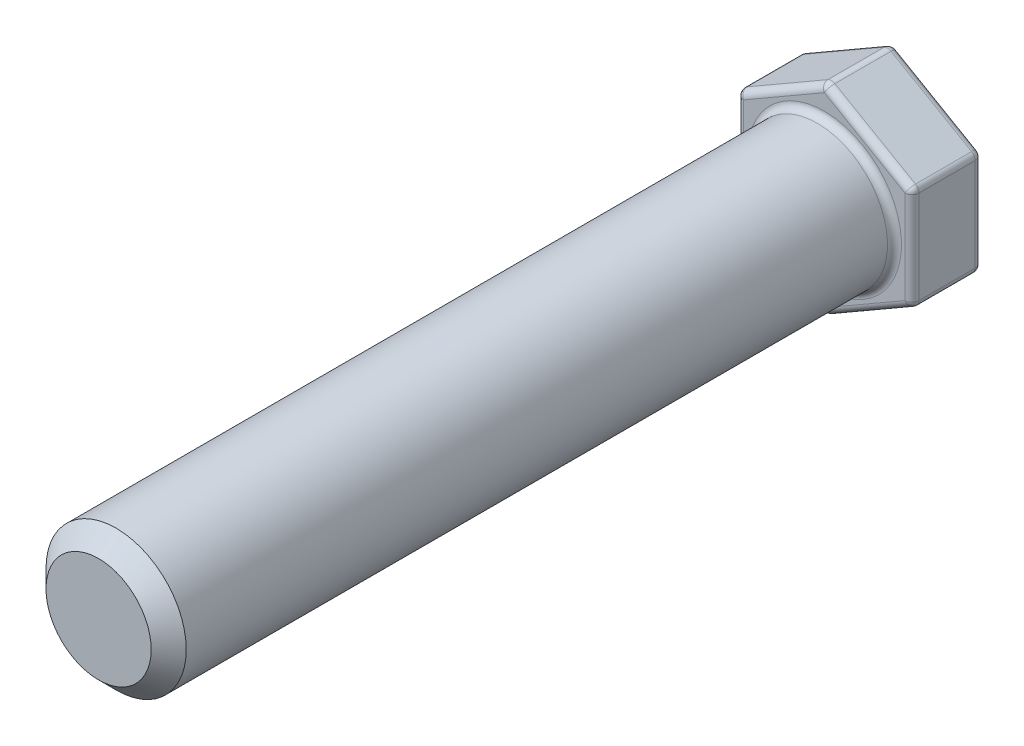
ISO-10303-21;
HEADER;
FILE_DESCRIPTION(('STEP AP214'),'2;1');
FILE_NAME('part.step','',(''),(''),'','','');
FILE_SCHEMA(('AUTOMOTIVE_DESIGN { 1 0 10303 214 1 1 1 1 }'));
ENDSEC;
DATA;
#1=APPLICATION_CONTEXT('core data for automotive mechanical design processes');
#2=APPLICATION_PROTOCOL_DEFINITION('international standard','automotive_design',2000,#1);
#3=PRODUCT_CONTEXT('',#1,'mechanical');
#4=PRODUCT('Part','Part','',(#3));
#5=PRODUCT_RELATED_PRODUCT_CATEGORY('part','',(#4));
#6=PRODUCT_DEFINITION_FORMATION('','',#4);
#7=PRODUCT_DEFINITION_CONTEXT('part definition',#1,'design');
#8=PRODUCT_DEFINITION('design','',#6,#7);
#9=PRODUCT_DEFINITION_SHAPE('','',#8);
#10=(LENGTH_UNIT() NAMED_UNIT(*) SI_UNIT(.MILLI.,.METRE.));
#11=(NAMED_UNIT(*) PLANE_ANGLE_UNIT() SI_UNIT($,.RADIAN.));
#12=(NAMED_UNIT(*) SI_UNIT($,.STERADIAN.) SOLID_ANGLE_UNIT());
#13=UNCERTAINTY_MEASURE_WITH_UNIT(LENGTH_MEASURE(1.E-05),#10,'distance_accuracy_value','');
#14=(GEOMETRIC_REPRESENTATION_CONTEXT(3) GLOBAL_UNCERTAINTY_ASSIGNED_CONTEXT((#13)) GLOBAL_UNIT_ASSIGNED_CONTEXT((#10,
#11,#12)) REPRESENTATION_CONTEXT('',''));
#15=CARTESIAN_POINT('',(0.,0.,0.));
#16=DIRECTION('',(0.,0.,1.));
#17=DIRECTION('',(1.,0.,0.));
#18=AXIS2_PLACEMENT_3D('',#15,#16,#17);
#19=CARTESIAN_POINT('',(0.,0.,20.7));
#20=DIRECTION('',(0.,0.,-1.));
#21=DIRECTION('',(-1.,0.,0.));
#22=AXIS2_PLACEMENT_3D('',#19,#20,#21);
#23=CYLINDRICAL_SURFACE('',#22,2.);
#24=CARTESIAN_POINT('',(0.,0.,20.2));
#25=DIRECTION('',(0.,0.,1.));
#26=DIRECTION('',(1.,0.,0.));
#27=AXIS2_PLACEMENT_3D('',#24,#25,#26);
#28=CIRCLE('',#27,2.);
#29=CARTESIAN_POINT('',(2.,0.,20.2));
#30=VERTEX_POINT('',#29);
#31=EDGE_CURVE('E11',#30,#30,#28,.F.);
#32=ORIENTED_EDGE('',*,*,#31,.T.);
#33=EDGE_LOOP('',(#32));
#34=FACE_BOUND('',#33,.T.);
#35=CARTESIAN_POINT('',(0.,0.,0.199999999999999));
#36=DIRECTION('',(0.,0.,-1.));
#37=DIRECTION('',(-1.,0.,0.));
#38=AXIS2_PLACEMENT_3D('',#35,#36,#37);
#39=CIRCLE('',#38,2.);
#40=CARTESIAN_POINT('',(-2.,0.,0.199999999999999));
#41=VERTEX_POINT('',#40);
#42=EDGE_CURVE('E261',#41,#41,#39,.F.);
#43=ORIENTED_EDGE('',*,*,#42,.T.);
#44=EDGE_LOOP('',(#43));
#45=FACE_BOUND('',#44,.T.);
#46=ADVANCED_FACE('F36',(#34,#45),#23,.T.);
#47=CARTESIAN_POINT('',(0.,0.,20.7));
#48=DIRECTION('',(0.,0.,1.));
#49=DIRECTION('',(1.,0.,0.));
#50=AXIS2_PLACEMENT_3D('',#47,#48,#49);
#51=PLANE('',#50);
#52=CARTESIAN_POINT('',(0.,0.,20.7));
#53=DIRECTION('',(0.,0.,1.));
#54=DIRECTION('',(1.,0.,0.));
#55=AXIS2_PLACEMENT_3D('',#52,#53,#54);
#56=CIRCLE('',#55,1.5);
#57=CARTESIAN_POINT('',(1.5,0.,20.7));
#58=VERTEX_POINT('',#57);
#59=EDGE_CURVE('E44',#58,#58,#56,.T.);
#60=ORIENTED_EDGE('',*,*,#59,.T.);
#61=EDGE_LOOP('',(#60));
#62=FACE_BOUND('',#61,.T.);
#63=ADVANCED_FACE('F362',(#62),#51,.T.);
#64=CARTESIAN_POINT('',(0.,2.88675134594813,-2.));
#65=DIRECTION('',(-0.500000000000001,-0.866025403784438,0.));
#66=DIRECTION('',(0.866025403784438,-0.500000000000001,0.));
#67=AXIS2_PLACEMENT_3D('',#64,#65,#66);
#68=PLANE('',#67);
#69=DIRECTION('',(0.866025403784438,-0.500000000000001,0.));
#70=VECTOR('',#69,1.);
#71=CARTESIAN_POINT('',(0.,2.88675134594813,-1.8));
#72=LINE('',#71,#70);
#73=CARTESIAN_POINT('',(2.4,1.50111069989303,-1.8));
#74=VERTEX_POINT('',#73);
#75=CARTESIAN_POINT('',(0.100000000000001,2.82901631902917,-1.8));
#76=VERTEX_POINT('',#75);
#77=EDGE_CURVE('E238',#74,#76,#72,.F.);
#78=ORIENTED_EDGE('',*,*,#77,.T.);
#79=DIRECTION('',(0.,0.,1.));
#80=VECTOR('',#79,1.);
#81=CARTESIAN_POINT('',(0.100000000000001,2.82901631902917,-2.));
#82=LINE('',#81,#80);
#83=CARTESIAN_POINT('',(0.100000000000001,2.82901631902917,-0.2));
#84=VERTEX_POINT('',#83);
#85=EDGE_CURVE('E309',#76,#84,#82,.T.);
#86=ORIENTED_EDGE('',*,*,#85,.T.);
#87=DIRECTION('',(0.866025403784438,-0.500000000000001,0.));
#88=VECTOR('',#87,1.);
#89=CARTESIAN_POINT('',(0.,2.88675134594813,-0.2));
#90=LINE('',#89,#88);
#91=CARTESIAN_POINT('',(2.4,1.50111069989303,-0.2));
#92=VERTEX_POINT('',#91);
#93=EDGE_CURVE('E235',#84,#92,#90,.T.);
#94=ORIENTED_EDGE('',*,*,#93,.T.);
#95=DIRECTION('',(0.,0.,1.));
#96=VECTOR('',#95,1.);
#97=CARTESIAN_POINT('',(2.4,1.50111069989303,-2.));
#98=LINE('',#97,#96);
#99=EDGE_CURVE('E307',#92,#74,#98,.F.);
#100=ORIENTED_EDGE('',*,*,#99,.T.);
#101=EDGE_LOOP('',(#78,#86,#94,#100));
#102=FACE_BOUND('',#101,.T.);
#103=ADVANCED_FACE('F380',(#102),#68,.F.);
#104=CARTESIAN_POINT('',(2.5,1.44337567297406,-2.));
#105=DIRECTION('',(-1.,0.,0.));
#106=DIRECTION('',(0.,0.,1.));
#107=AXIS2_PLACEMENT_3D('',#104,#105,#106);
#108=PLANE('',#107);
#109=DIRECTION('',(0.,-1.,0.));
#110=VECTOR('',#109,1.);
#111=CARTESIAN_POINT('',(2.5,1.44337567297406,-0.2));
#112=LINE('',#111,#110);
#113=CARTESIAN_POINT('',(2.5,1.32790561913614,-0.2));
#114=VERTEX_POINT('',#113);
#115=CARTESIAN_POINT('',(2.5,-1.32790561913614,-0.2));
#116=VERTEX_POINT('',#115);
#117=EDGE_CURVE('E231',#114,#116,#112,.T.);
#118=ORIENTED_EDGE('',*,*,#117,.T.);
#119=DIRECTION('',(0.,0.,1.));
#120=VECTOR('',#119,1.);
#121=CARTESIAN_POINT('',(2.5,-1.32790561913614,-2.));
#122=LINE('',#121,#120);
#123=CARTESIAN_POINT('',(2.5,-1.32790561913614,-1.8));
#124=VERTEX_POINT('',#123);
#125=EDGE_CURVE('E328',#116,#124,#122,.F.);
#126=ORIENTED_EDGE('',*,*,#125,.T.);
#127=DIRECTION('',(0.,-1.,0.));
#128=VECTOR('',#127,1.);
#129=CARTESIAN_POINT('',(2.5,1.44337567297406,-1.8));
#130=LINE('',#129,#128);
#131=CARTESIAN_POINT('',(2.5,1.32790561913614,-1.8));
#132=VERTEX_POINT('',#131);
#133=EDGE_CURVE('E233',#124,#132,#130,.F.);
#134=ORIENTED_EDGE('',*,*,#133,.T.);
#135=DIRECTION('',(0.,0.,1.));
#136=VECTOR('',#135,1.);
#137=CARTESIAN_POINT('',(2.5,1.32790561913614,-2.));
#138=LINE('',#137,#136);
#139=EDGE_CURVE('E58',#132,#114,#138,.T.);
#140=ORIENTED_EDGE('',*,*,#139,.T.);
#141=EDGE_LOOP('',(#118,#126,#134,#140));
#142=FACE_BOUND('',#141,.T.);
#143=ADVANCED_FACE('F546',(#142),#108,.F.);
#144=CARTESIAN_POINT('',(2.5,-1.44337567297406,-2.));
#145=DIRECTION('',(-0.5,0.866025403784439,0.));
#146=DIRECTION('',(-0.866025403784439,-0.5,0.));
#147=AXIS2_PLACEMENT_3D('',#144,#145,#146);
#148=PLANE('',#147);
#149=DIRECTION('',(-0.866025403784439,-0.5,0.));
#150=VECTOR('',#149,1.);
#151=CARTESIAN_POINT('',(2.5,-1.44337567297406,-0.2));
#152=LINE('',#151,#150);
#153=CARTESIAN_POINT('',(2.4,-1.50111069989303,-0.2));
#154=VERTEX_POINT('',#153);
#155=CARTESIAN_POINT('',(0.099999999999999,-2.82901631902917,-0.2));
#156=VERTEX_POINT('',#155);
#157=EDGE_CURVE('E225',#154,#156,#152,.T.);
#158=ORIENTED_EDGE('',*,*,#157,.T.);
#159=DIRECTION('',(0.,0.,1.));
#160=VECTOR('',#159,1.);
#161=CARTESIAN_POINT('',(0.1,-2.82901631902917,-2.));
#162=LINE('',#161,#160);
#163=CARTESIAN_POINT('',(0.099999999999999,-2.82901631902917,-1.8));
#164=VERTEX_POINT('',#163);
#165=EDGE_CURVE('E325',#156,#164,#162,.F.);
#166=ORIENTED_EDGE('',*,*,#165,.T.);
#167=DIRECTION('',(-0.866025403784439,-0.5,0.));
#168=VECTOR('',#167,1.);
#169=CARTESIAN_POINT('',(2.5,-1.44337567297406,-1.8));
#170=LINE('',#169,#168);
#171=CARTESIAN_POINT('',(2.4,-1.50111069989303,-1.8));
#172=VERTEX_POINT('',#171);
#173=EDGE_CURVE('E228',#164,#172,#170,.F.);
#174=ORIENTED_EDGE('',*,*,#173,.T.);
#175=DIRECTION('',(0.,0.,1.));
#176=VECTOR('',#175,1.);
#177=CARTESIAN_POINT('',(2.4,-1.50111069989303,-2.));
#178=LINE('',#177,#176);
#179=EDGE_CURVE('E323',#172,#154,#178,.T.);
#180=ORIENTED_EDGE('',*,*,#179,.T.);
#181=EDGE_LOOP('',(#158,#166,#174,#180));
#182=FACE_BOUND('',#181,.T.);
#183=ADVANCED_FACE('F542',(#182),#148,.F.);
#184=CARTESIAN_POINT('',(0.,-2.88675134594813,-2.));
#185=DIRECTION('',(0.5,0.866025403784438,0.));
#186=DIRECTION('',(-0.866025403784438,0.5,0.));
#187=AXIS2_PLACEMENT_3D('',#184,#185,#186);
#188=PLANE('',#187);
#189=DIRECTION('',(-0.866025403784438,0.5,0.));
#190=VECTOR('',#189,1.);
#191=CARTESIAN_POINT('',(0.,-2.88675134594813,-0.2));
#192=LINE('',#191,#190);
#193=CARTESIAN_POINT('',(-0.0999999999999999,-2.82901631902917,-0.2));
#194=VERTEX_POINT('',#193);
#195=CARTESIAN_POINT('',(-2.4,-1.50111069989303,-0.2));
#196=VERTEX_POINT('',#195);
#197=EDGE_CURVE('E219',#194,#196,#192,.T.);
#198=ORIENTED_EDGE('',*,*,#197,.T.);
#199=DIRECTION('',(0.,0.,1.));
#200=VECTOR('',#199,1.);
#201=CARTESIAN_POINT('',(-2.4,-1.50111069989303,-2.));
#202=LINE('',#201,#200);
#203=CARTESIAN_POINT('',(-2.4,-1.50111069989303,-1.8));
#204=VERTEX_POINT('',#203);
#205=EDGE_CURVE('E321',#196,#204,#202,.F.);
#206=ORIENTED_EDGE('',*,*,#205,.T.);
#207=DIRECTION('',(-0.866025403784438,0.5,0.));
#208=VECTOR('',#207,1.);
#209=CARTESIAN_POINT('',(0.,-2.88675134594813,-1.8));
#210=LINE('',#209,#208);
#211=CARTESIAN_POINT('',(-0.0999999999999998,-2.82901631902917,-1.8));
#212=VERTEX_POINT('',#211);
#213=EDGE_CURVE('E222',#204,#212,#210,.F.);
#214=ORIENTED_EDGE('',*,*,#213,.T.);
#215=DIRECTION('',(0.,0.,1.));
#216=VECTOR('',#215,1.);
#217=CARTESIAN_POINT('',(-0.0999999999999999,-2.82901631902917,-2.));
#218=LINE('',#217,#216);
#219=EDGE_CURVE('E319',#212,#194,#218,.T.);
#220=ORIENTED_EDGE('',*,*,#219,.T.);
#221=EDGE_LOOP('',(#198,#206,#214,#220));
#222=FACE_BOUND('',#221,.T.);
#223=ADVANCED_FACE('F536',(#222),#188,.F.);
#224=CARTESIAN_POINT('',(-2.5,-1.44337567297406,-2.));
#225=DIRECTION('',(1.,0.,0.));
#226=DIRECTION('',(0.,1.,0.));
#227=AXIS2_PLACEMENT_3D('',#224,#225,#226);
#228=PLANE('',#227);
#229=DIRECTION('',(0.,1.,0.));
#230=VECTOR('',#229,1.);
#231=CARTESIAN_POINT('',(-2.5,-1.44337567297406,-0.2));
#232=LINE('',#231,#230);
#233=CARTESIAN_POINT('',(-2.5,-1.32790561913614,-0.2));
#234=VERTEX_POINT('',#233);
#235=CARTESIAN_POINT('',(-2.5,1.32790561913614,-0.2));
#236=VERTEX_POINT('',#235);
#237=EDGE_CURVE('E213',#234,#236,#232,.T.);
#238=ORIENTED_EDGE('',*,*,#237,.T.);
#239=DIRECTION('',(0.,0.,1.));
#240=VECTOR('',#239,1.);
#241=CARTESIAN_POINT('',(-2.5,1.32790561913614,-2.));
#242=LINE('',#241,#240);
#243=CARTESIAN_POINT('',(-2.5,1.32790561913614,-1.8));
#244=VERTEX_POINT('',#243);
#245=EDGE_CURVE('E317',#236,#244,#242,.F.);
#246=ORIENTED_EDGE('',*,*,#245,.T.);
#247=DIRECTION('',(0.,1.,0.));
#248=VECTOR('',#247,1.);
#249=CARTESIAN_POINT('',(-2.5,-1.44337567297406,-1.8));
#250=LINE('',#249,#248);
#251=CARTESIAN_POINT('',(-2.5,-1.32790561913614,-1.8));
#252=VERTEX_POINT('',#251);
#253=EDGE_CURVE('E216',#244,#252,#250,.F.);
#254=ORIENTED_EDGE('',*,*,#253,.T.);
#255=DIRECTION('',(0.,0.,1.));
#256=VECTOR('',#255,1.);
#257=CARTESIAN_POINT('',(-2.5,-1.32790561913614,-2.));
#258=LINE('',#257,#256);
#259=EDGE_CURVE('E315',#252,#234,#258,.T.);
#260=ORIENTED_EDGE('',*,*,#259,.T.);
#261=EDGE_LOOP('',(#238,#246,#254,#260));
#262=FACE_BOUND('',#261,.T.);
#263=ADVANCED_FACE('F523',(#262),#228,.F.);
#264=CARTESIAN_POINT('',(-2.5,1.44337567297407,-2.));
#265=DIRECTION('',(0.5,-0.866025403784439,0.));
#266=DIRECTION('',(0.866025403784439,0.5,0.));
#267=AXIS2_PLACEMENT_3D('',#264,#265,#266);
#268=PLANE('',#267);
#269=DIRECTION('',(0.866025403784439,0.5,0.));
#270=VECTOR('',#269,1.);
#271=CARTESIAN_POINT('',(-2.5,1.44337567297407,-0.2));
#272=LINE('',#271,#270);
#273=CARTESIAN_POINT('',(-2.4,1.50111069989303,-0.2));
#274=VERTEX_POINT('',#273);
#275=CARTESIAN_POINT('',(-0.099999999999999,2.82901631902917,-0.2));
#276=VERTEX_POINT('',#275);
#277=EDGE_CURVE('E204',#274,#276,#272,.T.);
#278=ORIENTED_EDGE('',*,*,#277,.T.);
#279=DIRECTION('',(0.,0.,1.));
#280=VECTOR('',#279,1.);
#281=CARTESIAN_POINT('',(-0.0999999999999994,2.82901631902917,-2.));
#282=LINE('',#281,#280);
#283=CARTESIAN_POINT('',(-0.0999999999999985,2.82901631902917,-1.8));
#284=VERTEX_POINT('',#283);
#285=EDGE_CURVE('E313',#276,#284,#282,.F.);
#286=ORIENTED_EDGE('',*,*,#285,.T.);
#287=DIRECTION('',(0.866025403784439,0.5,0.));
#288=VECTOR('',#287,1.);
#289=CARTESIAN_POINT('',(-2.5,1.44337567297407,-1.8));
#290=LINE('',#289,#288);
#291=CARTESIAN_POINT('',(-2.4,1.50111069989303,-1.8));
#292=VERTEX_POINT('',#291);
#293=EDGE_CURVE('E185',#284,#292,#290,.F.);
#294=ORIENTED_EDGE('',*,*,#293,.T.);
#295=DIRECTION('',(0.,0.,1.));
#296=VECTOR('',#295,1.);
#297=CARTESIAN_POINT('',(-2.4,1.50111069989303,-2.));
#298=LINE('',#297,#296);
#299=EDGE_CURVE('E311',#292,#274,#298,.T.);
#300=ORIENTED_EDGE('',*,*,#299,.T.);
#301=EDGE_LOOP('',(#278,#286,#294,#300));
#302=FACE_BOUND('',#301,.T.);
#303=ADVANCED_FACE('F528',(#302),#268,.F.);
#304=CARTESIAN_POINT('',(0.,0.,-2.));
#305=DIRECTION('',(0.,0.,-1.));
#306=DIRECTION('',(-1.,0.,0.));
#307=AXIS2_PLACEMENT_3D('',#304,#305,#306);
#308=PLANE('',#307);
#309=DIRECTION('',(0.,1.,0.));
#310=VECTOR('',#309,1.);
#311=CARTESIAN_POINT('',(-2.3,1.44337567297407,-2.));
#312=LINE('',#311,#310);
#313=CARTESIAN_POINT('',(-2.3,-1.32790561913614,-2.));
#314=VERTEX_POINT('',#313);
#315=CARTESIAN_POINT('',(-2.3,1.32790561913614,-2.));
#316=VERTEX_POINT('',#315);
#317=EDGE_CURVE('E203',#314,#316,#312,.T.);
#318=ORIENTED_EDGE('',*,*,#317,.T.);
#319=DIRECTION('',(0.866025403784439,0.5,0.));
#320=VECTOR('',#319,1.);
#321=CARTESIAN_POINT('',(0.100000000000001,2.71354626519124,-2.));
#322=LINE('',#321,#320);
#323=CARTESIAN_POINT('',(0.,2.65581123827228,-2.));
#324=VERTEX_POINT('',#323);
#325=EDGE_CURVE('E182',#316,#324,#322,.T.);
#326=ORIENTED_EDGE('',*,*,#325,.T.);
#327=DIRECTION('',(0.866025403784438,-0.500000000000001,0.));
#328=VECTOR('',#327,1.);
#329=CARTESIAN_POINT('',(2.4,1.27017059221718,-2.));
#330=LINE('',#329,#328);
#331=CARTESIAN_POINT('',(2.3,1.32790561913614,-2.));
#332=VERTEX_POINT('',#331);
#333=EDGE_CURVE('E190',#324,#332,#330,.T.);
#334=ORIENTED_EDGE('',*,*,#333,.T.);
#335=DIRECTION('',(0.,-1.,0.));
#336=VECTOR('',#335,1.);
#337=CARTESIAN_POINT('',(2.3,-1.44337567297406,-2.));
#338=LINE('',#337,#336);
#339=CARTESIAN_POINT('',(2.3,-1.32790561913614,-2.));
#340=VERTEX_POINT('',#339);
#341=EDGE_CURVE('E196',#332,#340,#338,.T.);
#342=ORIENTED_EDGE('',*,*,#341,.T.);
#343=DIRECTION('',(-0.866025403784439,-0.5,0.));
#344=VECTOR('',#343,1.);
#345=CARTESIAN_POINT('',(-0.1,-2.71354626519124,-2.));
#346=LINE('',#345,#344);
#347=CARTESIAN_POINT('',(0.,-2.65581123827228,-2.));
#348=VERTEX_POINT('',#347);
#349=EDGE_CURVE('E828',#340,#348,#346,.T.);
#350=ORIENTED_EDGE('',*,*,#349,.T.);
#351=DIRECTION('',(-0.866025403784438,0.5,0.));
#352=VECTOR('',#351,1.);
#353=CARTESIAN_POINT('',(-2.4,-1.27017059221718,-2.));
#354=LINE('',#353,#352);
#355=EDGE_CURVE('E208',#348,#314,#354,.T.);
#356=ORIENTED_EDGE('',*,*,#355,.T.);
#357=EDGE_LOOP('',(#318,#326,#334,#342,#350,#356));
#358=FACE_BOUND('',#357,.T.);
#359=ADVANCED_FACE('F200',(#358),#308,.T.);
#360=CARTESIAN_POINT('',(0.,0.,0.));
#361=DIRECTION('',(0.,0.,-1.));
#362=DIRECTION('',(-1.,0.,0.));
#363=AXIS2_PLACEMENT_3D('',#360,#361,#362);
#364=PLANE('',#363);
#365=DIRECTION('',(-0.866025403784439,-0.5,0.));
#366=VECTOR('',#365,1.);
#367=CARTESIAN_POINT('',(1.15,-1.99185842870421,0.));
#368=LINE('',#367,#366);
#369=CARTESIAN_POINT('',(0.,-2.65581123827228,0.));
#370=VERTEX_POINT('',#369);
#371=CARTESIAN_POINT('',(2.3,-1.32790561913614,0.));
#372=VERTEX_POINT('',#371);
#373=EDGE_CURVE('E255',#370,#372,#368,.F.);
#374=ORIENTED_EDGE('',*,*,#373,.T.);
#375=DIRECTION('',(0.,-1.,0.));
#376=VECTOR('',#375,1.);
#377=CARTESIAN_POINT('',(2.3,0.,0.));
#378=LINE('',#377,#376);
#379=CARTESIAN_POINT('',(2.3,1.32790561913614,0.));
#380=VERTEX_POINT('',#379);
#381=EDGE_CURVE('E258',#372,#380,#378,.F.);
#382=ORIENTED_EDGE('',*,*,#381,.T.);
#383=DIRECTION('',(0.866025403784438,-0.500000000000001,0.));
#384=VECTOR('',#383,1.);
#385=CARTESIAN_POINT('',(1.15,1.99185842870421,0.));
#386=LINE('',#385,#384);
#387=CARTESIAN_POINT('',(0.,2.65581123827228,0.));
#388=VERTEX_POINT('',#387);
#389=EDGE_CURVE('E243',#380,#388,#386,.F.);
#390=ORIENTED_EDGE('',*,*,#389,.T.);
#391=DIRECTION('',(0.866025403784439,0.5,0.));
#392=VECTOR('',#391,1.);
#393=CARTESIAN_POINT('',(-1.15,1.99185842870421,0.));
#394=LINE('',#393,#392);
#395=CARTESIAN_POINT('',(-2.3,1.32790561913614,0.));
#396=VERTEX_POINT('',#395);
#397=EDGE_CURVE('E246',#388,#396,#394,.F.);
#398=ORIENTED_EDGE('',*,*,#397,.T.);
#399=DIRECTION('',(0.,1.,0.));
#400=VECTOR('',#399,1.);
#401=CARTESIAN_POINT('',(-2.3,0.,0.));
#402=LINE('',#401,#400);
#403=CARTESIAN_POINT('',(-2.3,-1.32790561913614,0.));
#404=VERTEX_POINT('',#403);
#405=EDGE_CURVE('E249',#396,#404,#402,.F.);
#406=ORIENTED_EDGE('',*,*,#405,.T.);
#407=DIRECTION('',(-0.866025403784438,0.5,0.));
#408=VECTOR('',#407,1.);
#409=CARTESIAN_POINT('',(-1.15,-1.99185842870421,0.));
#410=LINE('',#409,#408);
#411=EDGE_CURVE('E252',#404,#370,#410,.F.);
#412=ORIENTED_EDGE('',*,*,#411,.T.);
#413=EDGE_LOOP('',(#374,#382,#390,#398,#406,#412));
#414=FACE_BOUND('',#413,.T.);
#415=CARTESIAN_POINT('',(0.,0.,0.));
#416=DIRECTION('',(0.,0.,-1.));
#417=DIRECTION('',(-1.,0.,0.));
#418=AXIS2_PLACEMENT_3D('',#415,#416,#417);
#419=CIRCLE('',#418,2.2);
#420=CARTESIAN_POINT('',(-2.2,0.,0.));
#421=VERTEX_POINT('',#420);
#422=EDGE_CURVE('E240',#421,#421,#419,.T.);
#423=ORIENTED_EDGE('',*,*,#422,.T.);
#424=EDGE_LOOP('',(#423));
#425=FACE_BOUND('',#424,.T.);
#426=ADVANCED_FACE('F405',(#414,#425),#364,.F.);
#427=CARTESIAN_POINT('',(1.15,-1.99185842870421,-1.8));
#428=DIRECTION('',(0.866025403784439,0.5,0.));
#429=DIRECTION('',(-0.5,0.866025403784439,0.));
#430=AXIS2_PLACEMENT_3D('',#427,#428,#429);
#431=CYLINDRICAL_SURFACE('',#430,0.2);
#432=ORIENTED_EDGE('',*,*,#173,.F.);
#433=CARTESIAN_POINT('',(0.,-2.65581123827228,-1.8));
#434=DIRECTION('',(0.866025403784439,0.5,0.));
#435=DIRECTION('',(-0.5,0.866025403784439,0.));
#436=AXIS2_PLACEMENT_3D('',#433,#434,#435);
#437=CIRCLE('',#436,0.2);
#438=EDGE_CURVE('E293',#164,#348,#437,.T.);
#439=ORIENTED_EDGE('',*,*,#438,.T.);
#440=ORIENTED_EDGE('',*,*,#349,.F.);
#441=CARTESIAN_POINT('',(2.3,-1.32790561913614,-1.8));
#442=DIRECTION('',(0.866025403784439,0.5,0.));
#443=DIRECTION('',(-0.5,0.866025403784439,0.));
#444=AXIS2_PLACEMENT_3D('',#441,#442,#443);
#445=CIRCLE('',#444,0.2);
#446=EDGE_CURVE('E291',#340,#172,#445,.F.);
#447=ORIENTED_EDGE('',*,*,#446,.T.);
#448=EDGE_LOOP('',(#432,#439,#440,#447));
#449=FACE_BOUND('',#448,.T.);
#450=ADVANCED_FACE('F401',(#449),#431,.T.);
#451=CARTESIAN_POINT('',(-1.15,-1.99185842870421,-1.8));
#452=DIRECTION('',(0.866025403784438,-0.5,0.));
#453=DIRECTION('',(0.5,0.866025403784438,0.));
#454=AXIS2_PLACEMENT_3D('',#451,#452,#453);
#455=CYLINDRICAL_SURFACE('',#454,0.2);
#456=ORIENTED_EDGE('',*,*,#213,.F.);
#457=CARTESIAN_POINT('',(-2.3,-1.32790561913614,-1.8));
#458=DIRECTION('',(0.866025403784438,-0.5,0.));
#459=DIRECTION('',(0.5,0.866025403784438,0.));
#460=AXIS2_PLACEMENT_3D('',#457,#458,#459);
#461=CIRCLE('',#460,0.2);
#462=EDGE_CURVE('E285',#204,#314,#461,.T.);
#463=ORIENTED_EDGE('',*,*,#462,.T.);
#464=ORIENTED_EDGE('',*,*,#355,.F.);
#465=CARTESIAN_POINT('',(0.,-2.65581123827228,-1.8));
#466=DIRECTION('',(0.866025403784438,-0.5,0.));
#467=DIRECTION('',(0.5,0.866025403784438,0.));
#468=AXIS2_PLACEMENT_3D('',#465,#466,#467);
#469=CIRCLE('',#468,0.2);
#470=EDGE_CURVE('E282',#348,#212,#469,.F.);
#471=ORIENTED_EDGE('',*,*,#470,.T.);
#472=EDGE_LOOP('',(#456,#463,#464,#471));
#473=FACE_BOUND('',#472,.T.);
#474=ADVANCED_FACE('F397',(#473),#455,.T.);
#475=CARTESIAN_POINT('',(2.3,0.,-1.8));
#476=DIRECTION('',(0.,1.,0.));
#477=DIRECTION('',(0.,0.,1.));
#478=AXIS2_PLACEMENT_3D('',#475,#476,#477);
#479=CYLINDRICAL_SURFACE('',#478,0.2);
#480=ORIENTED_EDGE('',*,*,#133,.F.);
#481=CARTESIAN_POINT('',(2.3,-1.32790561913614,-1.8));
#482=DIRECTION('',(0.,1.,0.));
#483=DIRECTION('',(0.,0.,1.));
#484=AXIS2_PLACEMENT_3D('',#481,#482,#483);
#485=CIRCLE('',#484,0.2);
#486=EDGE_CURVE('E301',#124,#340,#485,.T.);
#487=ORIENTED_EDGE('',*,*,#486,.T.);
#488=ORIENTED_EDGE('',*,*,#341,.F.);
#489=CARTESIAN_POINT('',(2.3,1.32790561913614,-1.8));
#490=DIRECTION('',(0.,1.,0.));
#491=DIRECTION('',(0.,0.,1.));
#492=AXIS2_PLACEMENT_3D('',#489,#490,#491);
#493=CIRCLE('',#492,0.2);
#494=EDGE_CURVE('E299',#332,#132,#493,.F.);
#495=ORIENTED_EDGE('',*,*,#494,.T.);
#496=EDGE_LOOP('',(#480,#487,#488,#495));
#497=FACE_BOUND('',#496,.T.);
#498=ADVANCED_FACE('F393',(#497),#479,.T.);
#499=CARTESIAN_POINT('',(-2.3,0.,-1.8));
#500=DIRECTION('',(0.,-1.,0.));
#501=DIRECTION('',(1.,0.,0.));
#502=AXIS2_PLACEMENT_3D('',#499,#500,#501);
#503=CYLINDRICAL_SURFACE('',#502,0.2);
#504=ORIENTED_EDGE('',*,*,#253,.F.);
#505=CARTESIAN_POINT('',(-2.3,1.32790561913614,-1.8));
#506=DIRECTION('',(0.,-1.,0.));
#507=DIRECTION('',(1.,0.,0.));
#508=AXIS2_PLACEMENT_3D('',#505,#506,#507);
#509=CIRCLE('',#508,0.2);
#510=EDGE_CURVE('E276',#244,#316,#509,.T.);
#511=ORIENTED_EDGE('',*,*,#510,.T.);
#512=ORIENTED_EDGE('',*,*,#317,.F.);
#513=CARTESIAN_POINT('',(-2.3,-1.32790561913614,-1.8));
#514=DIRECTION('',(0.,-1.,0.));
#515=DIRECTION('',(1.,0.,0.));
#516=AXIS2_PLACEMENT_3D('',#513,#514,#515);
#517=CIRCLE('',#516,0.2);
#518=EDGE_CURVE('E273',#314,#252,#517,.F.);
#519=ORIENTED_EDGE('',*,*,#518,.T.);
#520=EDGE_LOOP('',(#504,#511,#512,#519));
#521=FACE_BOUND('',#520,.T.);
#522=ADVANCED_FACE('F390',(#521),#503,.T.);
#523=CARTESIAN_POINT('',(1.15,1.99185842870421,-1.8));
#524=DIRECTION('',(-0.866025403784438,0.500000000000001,0.));
#525=DIRECTION('',(-0.500000000000001,-0.866025403784438,0.));
#526=AXIS2_PLACEMENT_3D('',#523,#524,#525);
#527=CYLINDRICAL_SURFACE('',#526,0.2);
#528=ORIENTED_EDGE('',*,*,#333,.F.);
#529=CARTESIAN_POINT('',(0.,2.65581123827228,-1.8));
#530=DIRECTION('',(-0.866025403784438,0.500000000000001,0.));
#531=DIRECTION('',(-0.500000000000001,-0.866025403784438,0.));
#532=AXIS2_PLACEMENT_3D('',#529,#530,#531);
#533=CIRCLE('',#532,0.2);
#534=EDGE_CURVE('E163',#324,#76,#533,.F.);
#535=ORIENTED_EDGE('',*,*,#534,.T.);
#536=ORIENTED_EDGE('',*,*,#77,.F.);
#537=CARTESIAN_POINT('',(2.3,1.32790561913614,-1.8));
#538=DIRECTION('',(-0.866025403784438,0.500000000000001,0.));
#539=DIRECTION('',(-0.500000000000001,-0.866025403784438,0.));
#540=AXIS2_PLACEMENT_3D('',#537,#538,#539);
#541=CIRCLE('',#540,0.2);
#542=EDGE_CURVE('E174',#74,#332,#541,.T.);
#543=ORIENTED_EDGE('',*,*,#542,.T.);
#544=EDGE_LOOP('',(#528,#535,#536,#543));
#545=FACE_BOUND('',#544,.T.);
#546=ADVANCED_FACE('F191',(#545),#527,.T.);
#547=CARTESIAN_POINT('',(-1.15,1.99185842870421,-1.8));
#548=DIRECTION('',(-0.866025403784439,-0.5,0.));
#549=DIRECTION('',(0.5,-0.866025403784439,0.));
#550=AXIS2_PLACEMENT_3D('',#547,#548,#549);
#551=CYLINDRICAL_SURFACE('',#550,0.2);
#552=ORIENTED_EDGE('',*,*,#293,.F.);
#553=CARTESIAN_POINT('',(0.,2.65581123827228,-1.8));
#554=DIRECTION('',(-0.866025403784439,-0.5,0.));
#555=DIRECTION('',(0.5,-0.866025403784439,0.));
#556=AXIS2_PLACEMENT_3D('',#553,#554,#555);
#557=CIRCLE('',#556,0.2);
#558=EDGE_CURVE('E166',#284,#324,#557,.T.);
#559=ORIENTED_EDGE('',*,*,#558,.T.);
#560=ORIENTED_EDGE('',*,*,#325,.F.);
#561=CARTESIAN_POINT('',(-2.3,1.32790561913614,-1.8));
#562=DIRECTION('',(-0.866025403784439,-0.5,0.));
#563=DIRECTION('',(0.5,-0.866025403784439,0.));
#564=AXIS2_PLACEMENT_3D('',#561,#562,#563);
#565=CIRCLE('',#564,0.2);
#566=EDGE_CURVE('E186',#316,#292,#565,.F.);
#567=ORIENTED_EDGE('',*,*,#566,.T.);
#568=EDGE_LOOP('',(#552,#559,#560,#567));
#569=FACE_BOUND('',#568,.T.);
#570=ADVANCED_FACE('F179',(#569),#551,.T.);
#571=CARTESIAN_POINT('',(-2.3,-1.44337567297406,-0.2));
#572=DIRECTION('',(0.,1.,0.));
#573=DIRECTION('',(-1.,0.,0.));
#574=AXIS2_PLACEMENT_3D('',#571,#572,#573);
#575=CYLINDRICAL_SURFACE('',#574,0.2);
#576=ORIENTED_EDGE('',*,*,#405,.F.);
#577=CARTESIAN_POINT('',(-2.3,1.32790561913614,-0.2));
#578=DIRECTION('',(0.,1.,0.));
#579=DIRECTION('',(-1.,0.,0.));
#580=AXIS2_PLACEMENT_3D('',#577,#578,#579);
#581=CIRCLE('',#580,0.2);
#582=EDGE_CURVE('E280',#396,#236,#581,.F.);
#583=ORIENTED_EDGE('',*,*,#582,.T.);
#584=ORIENTED_EDGE('',*,*,#237,.F.);
#585=CARTESIAN_POINT('',(-2.3,-1.32790561913614,-0.2));
#586=DIRECTION('',(0.,1.,0.));
#587=DIRECTION('',(-1.,0.,0.));
#588=AXIS2_PLACEMENT_3D('',#585,#586,#587);
#589=CIRCLE('',#588,0.2);
#590=EDGE_CURVE('E278',#234,#404,#589,.T.);
#591=ORIENTED_EDGE('',*,*,#590,.T.);
#592=EDGE_LOOP('',(#576,#583,#584,#591));
#593=FACE_BOUND('',#592,.T.);
#594=ADVANCED_FACE('F387',(#593),#575,.T.);
#595=CARTESIAN_POINT('',(-2.4,1.27017059221718,-0.2));
#596=DIRECTION('',(0.866025403784439,0.5,0.));
#597=DIRECTION('',(-0.5,0.866025403784439,0.));
#598=AXIS2_PLACEMENT_3D('',#595,#596,#597);
#599=CYLINDRICAL_SURFACE('',#598,0.2);
#600=ORIENTED_EDGE('',*,*,#397,.F.);
#601=CARTESIAN_POINT('',(0.,2.65581123827228,-0.2));
#602=DIRECTION('',(0.866025403784439,0.5,0.));
#603=DIRECTION('',(-0.5,0.866025403784439,0.));
#604=AXIS2_PLACEMENT_3D('',#601,#602,#603);
#605=CIRCLE('',#604,0.2);
#606=EDGE_CURVE('E271',#388,#276,#605,.F.);
#607=ORIENTED_EDGE('',*,*,#606,.T.);
#608=ORIENTED_EDGE('',*,*,#277,.F.);
#609=CARTESIAN_POINT('',(-2.3,1.32790561913614,-0.2));
#610=DIRECTION('',(0.866025403784439,0.5,0.));
#611=DIRECTION('',(-0.5,0.866025403784439,0.));
#612=AXIS2_PLACEMENT_3D('',#609,#610,#611);
#613=CIRCLE('',#612,0.2);
#614=EDGE_CURVE('E269',#274,#396,#613,.T.);
#615=ORIENTED_EDGE('',*,*,#614,.T.);
#616=EDGE_LOOP('',(#600,#607,#608,#615));
#617=FACE_BOUND('',#616,.T.);
#618=ADVANCED_FACE('F422',(#617),#599,.T.);
#619=CARTESIAN_POINT('',(0.1,-2.71354626519124,-0.2));
#620=DIRECTION('',(-0.866025403784438,0.5,0.));
#621=DIRECTION('',(-0.5,-0.866025403784438,0.));
#622=AXIS2_PLACEMENT_3D('',#619,#620,#621);
#623=CYLINDRICAL_SURFACE('',#622,0.2);
#624=ORIENTED_EDGE('',*,*,#411,.F.);
#625=CARTESIAN_POINT('',(-2.3,-1.32790561913614,-0.2));
#626=DIRECTION('',(-0.866025403784438,0.5,0.));
#627=DIRECTION('',(-0.5,-0.866025403784438,0.));
#628=AXIS2_PLACEMENT_3D('',#625,#626,#627);
#629=CIRCLE('',#628,0.2);
#630=EDGE_CURVE('E289',#404,#196,#629,.F.);
#631=ORIENTED_EDGE('',*,*,#630,.T.);
#632=ORIENTED_EDGE('',*,*,#197,.F.);
#633=CARTESIAN_POINT('',(0.,-2.65581123827228,-0.2));
#634=DIRECTION('',(-0.866025403784438,0.5,0.));
#635=DIRECTION('',(-0.5,-0.866025403784438,0.));
#636=AXIS2_PLACEMENT_3D('',#633,#634,#635);
#637=CIRCLE('',#636,0.2);
#638=EDGE_CURVE('E287',#194,#370,#637,.T.);
#639=ORIENTED_EDGE('',*,*,#638,.T.);
#640=EDGE_LOOP('',(#624,#631,#632,#639));
#641=FACE_BOUND('',#640,.T.);
#642=ADVANCED_FACE('F418',(#641),#623,.T.);
#643=CARTESIAN_POINT('',(-0.0999999999999993,2.71354626519124,-0.2));
#644=DIRECTION('',(0.866025403784438,-0.500000000000001,0.));
#645=DIRECTION('',(0.500000000000001,0.866025403784438,0.));
#646=AXIS2_PLACEMENT_3D('',#643,#644,#645);
#647=CYLINDRICAL_SURFACE('',#646,0.2);
#648=ORIENTED_EDGE('',*,*,#93,.F.);
#649=CARTESIAN_POINT('',(0.,2.65581123827228,-0.2));
#650=DIRECTION('',(0.866025403784438,-0.500000000000001,0.));
#651=DIRECTION('',(0.500000000000001,0.866025403784438,0.));
#652=AXIS2_PLACEMENT_3D('',#649,#650,#651);
#653=CIRCLE('',#652,0.2);
#654=EDGE_CURVE('E267',#84,#388,#653,.T.);
#655=ORIENTED_EDGE('',*,*,#654,.T.);
#656=ORIENTED_EDGE('',*,*,#389,.F.);
#657=CARTESIAN_POINT('',(2.3,1.32790561913614,-0.2));
#658=DIRECTION('',(0.866025403784438,-0.500000000000001,0.));
#659=DIRECTION('',(0.500000000000001,0.866025403784438,0.));
#660=AXIS2_PLACEMENT_3D('',#657,#658,#659);
#661=CIRCLE('',#660,0.2);
#662=EDGE_CURVE('E173',#380,#92,#661,.F.);
#663=ORIENTED_EDGE('',*,*,#662,.T.);
#664=EDGE_LOOP('',(#648,#655,#656,#663));
#665=FACE_BOUND('',#664,.T.);
#666=ADVANCED_FACE('F414',(#665),#647,.T.);
#667=CARTESIAN_POINT('',(2.4,-1.27017059221718,-0.2));
#668=DIRECTION('',(-0.866025403784439,-0.5,0.));
#669=DIRECTION('',(0.5,-0.866025403784439,0.));
#670=AXIS2_PLACEMENT_3D('',#667,#668,#669);
#671=CYLINDRICAL_SURFACE('',#670,0.2);
#672=ORIENTED_EDGE('',*,*,#373,.F.);
#673=CARTESIAN_POINT('',(0.,-2.65581123827228,-0.2));
#674=DIRECTION('',(-0.866025403784439,-0.5,0.));
#675=DIRECTION('',(0.5,-0.866025403784439,0.));
#676=AXIS2_PLACEMENT_3D('',#673,#674,#675);
#677=CIRCLE('',#676,0.2);
#678=EDGE_CURVE('E297',#370,#156,#677,.F.);
#679=ORIENTED_EDGE('',*,*,#678,.T.);
#680=ORIENTED_EDGE('',*,*,#157,.F.);
#681=CARTESIAN_POINT('',(2.3,-1.32790561913614,-0.2));
#682=DIRECTION('',(-0.866025403784439,-0.5,0.));
#683=DIRECTION('',(0.5,-0.866025403784439,0.));
#684=AXIS2_PLACEMENT_3D('',#681,#682,#683);
#685=CIRCLE('',#684,0.2);
#686=EDGE_CURVE('E295',#154,#372,#685,.T.);
#687=ORIENTED_EDGE('',*,*,#686,.T.);
#688=EDGE_LOOP('',(#672,#679,#680,#687));
#689=FACE_BOUND('',#688,.T.);
#690=ADVANCED_FACE('F411',(#689),#671,.T.);
#691=CARTESIAN_POINT('',(2.3,1.44337567297406,-0.2));
#692=DIRECTION('',(0.,-1.,0.));
#693=DIRECTION('',(0.,0.,-1.));
#694=AXIS2_PLACEMENT_3D('',#691,#692,#693);
#695=CYLINDRICAL_SURFACE('',#694,0.2);
#696=ORIENTED_EDGE('',*,*,#381,.F.);
#697=CARTESIAN_POINT('',(2.3,-1.32790561913614,-0.2));
#698=DIRECTION('',(0.,-1.,0.));
#699=DIRECTION('',(0.,0.,-1.));
#700=AXIS2_PLACEMENT_3D('',#697,#698,#699);
#701=CIRCLE('',#700,0.2);
#702=EDGE_CURVE('E51',#372,#116,#701,.F.);
#703=ORIENTED_EDGE('',*,*,#702,.T.);
#704=ORIENTED_EDGE('',*,*,#117,.F.);
#705=CARTESIAN_POINT('',(2.3,1.32790561913614,-0.2));
#706=DIRECTION('',(0.,-1.,0.));
#707=DIRECTION('',(0.,0.,-1.));
#708=AXIS2_PLACEMENT_3D('',#705,#706,#707);
#709=CIRCLE('',#708,0.2);
#710=EDGE_CURVE('E304',#114,#380,#709,.T.);
#711=ORIENTED_EDGE('',*,*,#710,.T.);
#712=EDGE_LOOP('',(#696,#703,#704,#711));
#713=FACE_BOUND('',#712,.T.);
#714=ADVANCED_FACE('F407',(#713),#695,.T.);
#715=CARTESIAN_POINT('',(0.,0.,0.199999999999999));
#716=DIRECTION('',(0.,0.,-1.));
#717=DIRECTION('',(-1.,0.,0.));
#718=AXIS2_PLACEMENT_3D('',#715,#716,#717);
#719=TOROIDAL_SURFACE('',#718,2.2,0.2);
#720=ORIENTED_EDGE('',*,*,#422,.F.);
#721=EDGE_LOOP('',(#720));
#722=FACE_BOUND('',#721,.T.);
#723=ORIENTED_EDGE('',*,*,#42,.F.);
#724=EDGE_LOOP('',(#723));
#725=FACE_BOUND('',#724,.T.);
#726=ADVANCED_FACE('F410',(#722,#725),#719,.F.);
#727=CARTESIAN_POINT('',(0.,2.65581123827228,-0.2));
#728=DIRECTION('',(0.,0.,1.));
#729=DIRECTION('',(1.,0.,0.));
#730=AXIS2_PLACEMENT_3D('',#727,#728,#729);
#731=SPHERICAL_SURFACE('',#730,0.2);
#732=ORIENTED_EDGE('',*,*,#606,.F.);
#733=ORIENTED_EDGE('',*,*,#654,.F.);
#734=CARTESIAN_POINT('',(0.,2.65581123827228,-0.2));
#735=DIRECTION('',(0.,0.,-1.));
#736=DIRECTION('',(-1.,0.,0.));
#737=AXIS2_PLACEMENT_3D('',#734,#735,#736);
#738=CIRCLE('',#737,0.2);
#739=EDGE_CURVE('E197',#276,#84,#738,.T.);
#740=ORIENTED_EDGE('',*,*,#739,.F.);
#741=EDGE_LOOP('',(#732,#733,#740));
#742=FACE_BOUND('',#741,.T.);
#743=ADVANCED_FACE('F432',(#742),#731,.T.);
#744=CARTESIAN_POINT('',(0.,2.65581123827228,-2.));
#745=DIRECTION('',(0.,0.,1.));
#746=DIRECTION('',(1.,0.,0.));
#747=AXIS2_PLACEMENT_3D('',#744,#745,#746);
#748=CYLINDRICAL_SURFACE('',#747,0.2);
#749=ORIENTED_EDGE('',*,*,#739,.T.);
#750=ORIENTED_EDGE('',*,*,#85,.F.);
#751=CARTESIAN_POINT('',(0.,2.65581123827228,-1.8));
#752=DIRECTION('',(0.,0.,-1.));
#753=DIRECTION('',(-1.,0.,0.));
#754=AXIS2_PLACEMENT_3D('',#751,#752,#753);
#755=CIRCLE('',#754,0.2);
#756=EDGE_CURVE('E168',#284,#76,#755,.T.);
#757=ORIENTED_EDGE('',*,*,#756,.F.);
#758=ORIENTED_EDGE('',*,*,#285,.F.);
#759=EDGE_LOOP('',(#749,#750,#757,#758));
#760=FACE_BOUND('',#759,.T.);
#761=ADVANCED_FACE('F437',(#760),#748,.T.);
#762=CARTESIAN_POINT('',(0.,2.65581123827228,-1.8));
#763=DIRECTION('',(0.,0.,1.));
#764=DIRECTION('',(1.,0.,0.));
#765=AXIS2_PLACEMENT_3D('',#762,#763,#764);
#766=SPHERICAL_SURFACE('',#765,0.2);
#767=ORIENTED_EDGE('',*,*,#756,.T.);
#768=ORIENTED_EDGE('',*,*,#534,.F.);
#769=ORIENTED_EDGE('',*,*,#558,.F.);
#770=EDGE_LOOP('',(#767,#768,#769));
#771=FACE_BOUND('',#770,.T.);
#772=ADVANCED_FACE('F165',(#771),#766,.T.);
#773=CARTESIAN_POINT('',(-2.3,1.32790561913614,-0.2));
#774=DIRECTION('',(0.,0.,1.));
#775=DIRECTION('',(1.,0.,0.));
#776=AXIS2_PLACEMENT_3D('',#773,#774,#775);
#777=SPHERICAL_SURFACE('',#776,0.2);
#778=ORIENTED_EDGE('',*,*,#582,.F.);
#779=ORIENTED_EDGE('',*,*,#614,.F.);
#780=CARTESIAN_POINT('',(-2.3,1.32790561913614,-0.2));
#781=DIRECTION('',(0.,0.,-1.));
#782=DIRECTION('',(-1.,0.,0.));
#783=AXIS2_PLACEMENT_3D('',#780,#781,#782);
#784=CIRCLE('',#783,0.2);
#785=EDGE_CURVE('E331',#236,#274,#784,.T.);
#786=ORIENTED_EDGE('',*,*,#785,.F.);
#787=EDGE_LOOP('',(#778,#779,#786));
#788=FACE_BOUND('',#787,.T.);
#789=ADVANCED_FACE('F436',(#788),#777,.T.);
#790=CARTESIAN_POINT('',(-2.3,1.32790561913614,-2.));
#791=DIRECTION('',(0.,0.,1.));
#792=DIRECTION('',(1.,0.,0.));
#793=AXIS2_PLACEMENT_3D('',#790,#791,#792);
#794=CYLINDRICAL_SURFACE('',#793,0.2);
#795=ORIENTED_EDGE('',*,*,#785,.T.);
#796=ORIENTED_EDGE('',*,*,#299,.F.);
#797=CARTESIAN_POINT('',(-2.3,1.32790561913614,-1.8));
#798=DIRECTION('',(0.,0.,-1.));
#799=DIRECTION('',(-1.,0.,0.));
#800=AXIS2_PLACEMENT_3D('',#797,#798,#799);
#801=CIRCLE('',#800,0.2);
#802=EDGE_CURVE('E334',#244,#292,#801,.T.);
#803=ORIENTED_EDGE('',*,*,#802,.F.);
#804=ORIENTED_EDGE('',*,*,#245,.F.);
#805=EDGE_LOOP('',(#795,#796,#803,#804));
#806=FACE_BOUND('',#805,.T.);
#807=ADVANCED_FACE('F448',(#806),#794,.T.);
#808=CARTESIAN_POINT('',(-2.3,1.32790561913614,-1.8));
#809=DIRECTION('',(0.,0.,1.));
#810=DIRECTION('',(1.,0.,0.));
#811=AXIS2_PLACEMENT_3D('',#808,#809,#810);
#812=SPHERICAL_SURFACE('',#811,0.2);
#813=ORIENTED_EDGE('',*,*,#566,.F.);
#814=ORIENTED_EDGE('',*,*,#510,.F.);
#815=ORIENTED_EDGE('',*,*,#802,.T.);
#816=EDGE_LOOP('',(#813,#814,#815));
#817=FACE_BOUND('',#816,.T.);
#818=ADVANCED_FACE('F444',(#817),#812,.T.);
#819=CARTESIAN_POINT('',(-2.3,-1.32790561913614,-0.2));
#820=DIRECTION('',(0.,0.,1.));
#821=DIRECTION('',(1.,0.,0.));
#822=AXIS2_PLACEMENT_3D('',#819,#820,#821);
#823=SPHERICAL_SURFACE('',#822,0.2);
#824=ORIENTED_EDGE('',*,*,#630,.F.);
#825=ORIENTED_EDGE('',*,*,#590,.F.);
#826=CARTESIAN_POINT('',(-2.3,-1.32790561913614,-0.2));
#827=DIRECTION('',(0.,0.,-1.));
#828=DIRECTION('',(-1.,0.,0.));
#829=AXIS2_PLACEMENT_3D('',#826,#827,#828);
#830=CIRCLE('',#829,0.2);
#831=EDGE_CURVE('E336',#196,#234,#830,.T.);
#832=ORIENTED_EDGE('',*,*,#831,.F.);
#833=EDGE_LOOP('',(#824,#825,#832));
#834=FACE_BOUND('',#833,.T.);
#835=ADVANCED_FACE('F447',(#834),#823,.T.);
#836=CARTESIAN_POINT('',(-2.3,-1.32790561913614,-2.));
#837=DIRECTION('',(0.,0.,1.));
#838=DIRECTION('',(1.,0.,0.));
#839=AXIS2_PLACEMENT_3D('',#836,#837,#838);
#840=CYLINDRICAL_SURFACE('',#839,0.2);
#841=ORIENTED_EDGE('',*,*,#831,.T.);
#842=ORIENTED_EDGE('',*,*,#259,.F.);
#843=CARTESIAN_POINT('',(-2.3,-1.32790561913614,-1.8));
#844=DIRECTION('',(0.,0.,-1.));
#845=DIRECTION('',(-1.,0.,0.));
#846=AXIS2_PLACEMENT_3D('',#843,#844,#845);
#847=CIRCLE('',#846,0.2);
#848=EDGE_CURVE('E339',#204,#252,#847,.T.);
#849=ORIENTED_EDGE('',*,*,#848,.F.);
#850=ORIENTED_EDGE('',*,*,#205,.F.);
#851=EDGE_LOOP('',(#841,#842,#849,#850));
#852=FACE_BOUND('',#851,.T.);
#853=ADVANCED_FACE('F460',(#852),#840,.T.);
#854=CARTESIAN_POINT('',(-2.3,-1.32790561913614,-1.8));
#855=DIRECTION('',(0.,0.,1.));
#856=DIRECTION('',(1.,0.,0.));
#857=AXIS2_PLACEMENT_3D('',#854,#855,#856);
#858=SPHERICAL_SURFACE('',#857,0.2);
#859=ORIENTED_EDGE('',*,*,#518,.F.);
#860=ORIENTED_EDGE('',*,*,#462,.F.);
#861=ORIENTED_EDGE('',*,*,#848,.T.);
#862=EDGE_LOOP('',(#859,#860,#861));
#863=FACE_BOUND('',#862,.T.);
#864=ADVANCED_FACE('F456',(#863),#858,.T.);
#865=CARTESIAN_POINT('',(0.,-2.65581123827228,-0.2));
#866=DIRECTION('',(0.,0.,1.));
#867=DIRECTION('',(1.,0.,0.));
#868=AXIS2_PLACEMENT_3D('',#865,#866,#867);
#869=SPHERICAL_SURFACE('',#868,0.2);
#870=ORIENTED_EDGE('',*,*,#678,.F.);
#871=ORIENTED_EDGE('',*,*,#638,.F.);
#872=CARTESIAN_POINT('',(0.,-2.65581123827228,-0.2));
#873=DIRECTION('',(0.,0.,-1.));
#874=DIRECTION('',(-1.,0.,0.));
#875=AXIS2_PLACEMENT_3D('',#872,#873,#874);
#876=CIRCLE('',#875,0.2);
#877=EDGE_CURVE('E341',#156,#194,#876,.T.);
#878=ORIENTED_EDGE('',*,*,#877,.F.);
#879=EDGE_LOOP('',(#870,#871,#878));
#880=FACE_BOUND('',#879,.T.);
#881=ADVANCED_FACE('F459',(#880),#869,.T.);
#882=CARTESIAN_POINT('',(0.,-2.65581123827228,-2.));
#883=DIRECTION('',(0.,0.,1.));
#884=DIRECTION('',(1.,0.,0.));
#885=AXIS2_PLACEMENT_3D('',#882,#883,#884);
#886=CYLINDRICAL_SURFACE('',#885,0.2);
#887=ORIENTED_EDGE('',*,*,#877,.T.);
#888=ORIENTED_EDGE('',*,*,#219,.F.);
#889=CARTESIAN_POINT('',(0.,-2.65581123827228,-1.8));
#890=DIRECTION('',(0.,0.,-1.));
#891=DIRECTION('',(-1.,0.,0.));
#892=AXIS2_PLACEMENT_3D('',#889,#890,#891);
#893=CIRCLE('',#892,0.2);
#894=EDGE_CURVE('E344',#164,#212,#893,.T.);
#895=ORIENTED_EDGE('',*,*,#894,.F.);
#896=ORIENTED_EDGE('',*,*,#165,.F.);
#897=EDGE_LOOP('',(#887,#888,#895,#896));
#898=FACE_BOUND('',#897,.T.);
#899=ADVANCED_FACE('F472',(#898),#886,.T.);
#900=CARTESIAN_POINT('',(0.,-2.65581123827228,-1.8));
#901=DIRECTION('',(0.,0.,1.));
#902=DIRECTION('',(1.,0.,0.));
#903=AXIS2_PLACEMENT_3D('',#900,#901,#902);
#904=SPHERICAL_SURFACE('',#903,0.2);
#905=ORIENTED_EDGE('',*,*,#470,.F.);
#906=ORIENTED_EDGE('',*,*,#438,.F.);
#907=ORIENTED_EDGE('',*,*,#894,.T.);
#908=EDGE_LOOP('',(#905,#906,#907));
#909=FACE_BOUND('',#908,.T.);
#910=ADVANCED_FACE('F468',(#909),#904,.T.);
#911=CARTESIAN_POINT('',(2.3,-1.32790561913614,-0.2));
#912=DIRECTION('',(0.,0.,1.));
#913=DIRECTION('',(1.,0.,0.));
#914=AXIS2_PLACEMENT_3D('',#911,#912,#913);
#915=SPHERICAL_SURFACE('',#914,0.2);
#916=ORIENTED_EDGE('',*,*,#702,.F.);
#917=ORIENTED_EDGE('',*,*,#686,.F.);
#918=CARTESIAN_POINT('',(2.3,-1.32790561913614,-0.2));
#919=DIRECTION('',(0.,0.,-1.));
#920=DIRECTION('',(-1.,0.,0.));
#921=AXIS2_PLACEMENT_3D('',#918,#919,#920);
#922=CIRCLE('',#921,0.2);
#923=EDGE_CURVE('E346',#116,#154,#922,.T.);
#924=ORIENTED_EDGE('',*,*,#923,.F.);
#925=EDGE_LOOP('',(#916,#917,#924));
#926=FACE_BOUND('',#925,.T.);
#927=ADVANCED_FACE('F471',(#926),#915,.T.);
#928=CARTESIAN_POINT('',(2.3,-1.32790561913614,-2.));
#929=DIRECTION('',(0.,0.,1.));
#930=DIRECTION('',(1.,0.,0.));
#931=AXIS2_PLACEMENT_3D('',#928,#929,#930);
#932=CYLINDRICAL_SURFACE('',#931,0.2);
#933=ORIENTED_EDGE('',*,*,#923,.T.);
#934=ORIENTED_EDGE('',*,*,#179,.F.);
#935=CARTESIAN_POINT('',(2.3,-1.32790561913614,-1.8));
#936=DIRECTION('',(0.,0.,-1.));
#937=DIRECTION('',(-1.,0.,0.));
#938=AXIS2_PLACEMENT_3D('',#935,#936,#937);
#939=CIRCLE('',#938,0.2);
#940=EDGE_CURVE('E349',#124,#172,#939,.T.);
#941=ORIENTED_EDGE('',*,*,#940,.F.);
#942=ORIENTED_EDGE('',*,*,#125,.F.);
#943=EDGE_LOOP('',(#933,#934,#941,#942));
#944=FACE_BOUND('',#943,.T.);
#945=ADVANCED_FACE('F484',(#944),#932,.T.);
#946=CARTESIAN_POINT('',(2.3,-1.32790561913614,-1.8));
#947=DIRECTION('',(0.,0.,1.));
#948=DIRECTION('',(1.,0.,0.));
#949=AXIS2_PLACEMENT_3D('',#946,#947,#948);
#950=SPHERICAL_SURFACE('',#949,0.2);
#951=ORIENTED_EDGE('',*,*,#940,.T.);
#952=ORIENTED_EDGE('',*,*,#446,.F.);
#953=ORIENTED_EDGE('',*,*,#486,.F.);
#954=EDGE_LOOP('',(#951,#952,#953));
#955=FACE_BOUND('',#954,.T.);
#956=ADVANCED_FACE('F480',(#955),#950,.T.);
#957=CARTESIAN_POINT('',(2.3,1.32790561913614,-0.2));
#958=DIRECTION('',(0.,0.,1.));
#959=DIRECTION('',(1.,0.,0.));
#960=AXIS2_PLACEMENT_3D('',#957,#958,#959);
#961=SPHERICAL_SURFACE('',#960,0.2);
#962=ORIENTED_EDGE('',*,*,#662,.F.);
#963=ORIENTED_EDGE('',*,*,#710,.F.);
#964=CARTESIAN_POINT('',(2.3,1.32790561913614,-0.2));
#965=DIRECTION('',(0.,0.,-1.));
#966=DIRECTION('',(-1.,0.,0.));
#967=AXIS2_PLACEMENT_3D('',#964,#965,#966);
#968=CIRCLE('',#967,0.2);
#969=EDGE_CURVE('E352',#92,#114,#968,.T.);
#970=ORIENTED_EDGE('',*,*,#969,.F.);
#971=EDGE_LOOP('',(#962,#963,#970));
#972=FACE_BOUND('',#971,.T.);
#973=ADVANCED_FACE('F483',(#972),#961,.T.);
#974=CARTESIAN_POINT('',(2.3,1.32790561913614,-2.));
#975=DIRECTION('',(0.,0.,1.));
#976=DIRECTION('',(1.,0.,0.));
#977=AXIS2_PLACEMENT_3D('',#974,#975,#976);
#978=CYLINDRICAL_SURFACE('',#977,0.2);
#979=ORIENTED_EDGE('',*,*,#969,.T.);
#980=ORIENTED_EDGE('',*,*,#139,.F.);
#981=CARTESIAN_POINT('',(2.3,1.32790561913614,-1.8));
#982=DIRECTION('',(0.,0.,-1.));
#983=DIRECTION('',(-1.,0.,0.));
#984=AXIS2_PLACEMENT_3D('',#981,#982,#983);
#985=CIRCLE('',#984,0.2);
#986=EDGE_CURVE('E355',#74,#132,#985,.T.);
#987=ORIENTED_EDGE('',*,*,#986,.F.);
#988=ORIENTED_EDGE('',*,*,#99,.F.);
#989=EDGE_LOOP('',(#979,#980,#987,#988));
#990=FACE_BOUND('',#989,.T.);
#991=ADVANCED_FACE('F370',(#990),#978,.T.);
#992=CARTESIAN_POINT('',(2.3,1.32790561913614,-1.8));
#993=DIRECTION('',(0.,0.,1.));
#994=DIRECTION('',(1.,0.,0.));
#995=AXIS2_PLACEMENT_3D('',#992,#993,#994);
#996=SPHERICAL_SURFACE('',#995,0.2);
#997=ORIENTED_EDGE('',*,*,#986,.T.);
#998=ORIENTED_EDGE('',*,*,#494,.F.);
#999=ORIENTED_EDGE('',*,*,#542,.F.);
#1000=EDGE_LOOP('',(#997,#998,#999));
#1001=FACE_BOUND('',#1000,.T.);
#1002=ADVANCED_FACE('F365',(#1001),#996,.T.);
#1003=CARTESIAN_POINT('',(0.,0.,20.7));
#1004=DIRECTION('',(0.,0.,-1.));
#1005=DIRECTION('',(-1.,0.,0.));
#1006=AXIS2_PLACEMENT_3D('',#1003,#1004,#1005);
#1007=CONICAL_SURFACE('',#1006,1.5,0.785398163397447);
#1008=ORIENTED_EDGE('',*,*,#31,.F.);
#1009=EDGE_LOOP('',(#1008));
#1010=FACE_BOUND('',#1009,.T.);
#1011=ORIENTED_EDGE('',*,*,#59,.F.);
#1012=EDGE_LOOP('',(#1011));
#1013=FACE_BOUND('',#1012,.T.);
#1014=ADVANCED_FACE('F38',(#1010,#1013),#1007,.T.);
#1015=CLOSED_SHELL('',(#46,#63,#103,#143,#183,#223,#263,#303,#359,#426,#450,#474,#498,#522,#546,
#570,#594,#618,#642,#666,#690,#714,#726,#743,#761,#772,#789,#807,#818,#835,#853,#864,#881,#899,
#910,#927,#945,#956,#973,#991,#1002,#1014));
#1016=MANIFOLD_SOLID_BREP('B2',#1015);
#1017=ADVANCED_BREP_SHAPE_REPRESENTATION('',(#18,#1016),#14);
#1018=SHAPE_DEFINITION_REPRESENTATION(#9,#1017);
ENDSEC;
END-ISO-10303-21;
